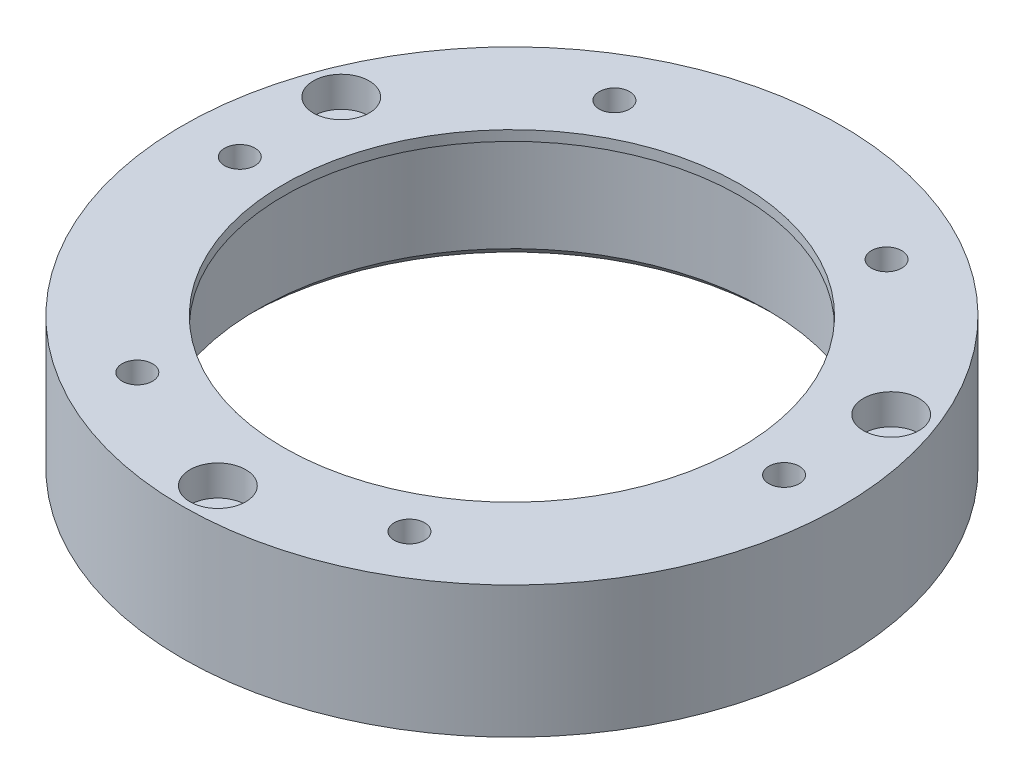
ISO-10303-21;
HEADER;
FILE_DESCRIPTION(('STEP AP214'),'2;1');
FILE_NAME('part.step','',(''),(''),'','','');
FILE_SCHEMA(('AUTOMOTIVE_DESIGN { 1 0 10303 214 1 1 1 1 }'));
ENDSEC;
DATA;
#1=APPLICATION_CONTEXT('core data for automotive mechanical design processes');
#2=APPLICATION_PROTOCOL_DEFINITION('international standard','automotive_design',2000,#1);
#3=PRODUCT_CONTEXT('',#1,'mechanical');
#4=PRODUCT('Part','Part','',(#3));
#5=PRODUCT_RELATED_PRODUCT_CATEGORY('part','',(#4));
#6=PRODUCT_DEFINITION_FORMATION('','',#4);
#7=PRODUCT_DEFINITION_CONTEXT('part definition',#1,'design');
#8=PRODUCT_DEFINITION('design','',#6,#7);
#9=PRODUCT_DEFINITION_SHAPE('','',#8);
#10=(LENGTH_UNIT() NAMED_UNIT(*) SI_UNIT(.MILLI.,.METRE.));
#11=(NAMED_UNIT(*) PLANE_ANGLE_UNIT() SI_UNIT($,.RADIAN.));
#12=(NAMED_UNIT(*) SI_UNIT($,.STERADIAN.) SOLID_ANGLE_UNIT());
#13=UNCERTAINTY_MEASURE_WITH_UNIT(LENGTH_MEASURE(1.E-05),#10,'distance_accuracy_value','');
#14=(GEOMETRIC_REPRESENTATION_CONTEXT(3) GLOBAL_UNCERTAINTY_ASSIGNED_CONTEXT((#13)) GLOBAL_UNIT_ASSIGNED_CONTEXT((#10,
#11,#12)) REPRESENTATION_CONTEXT('',''));
#15=CARTESIAN_POINT('',(0.,0.,0.));
#16=DIRECTION('',(0.,0.,1.));
#17=DIRECTION('',(1.,0.,0.));
#18=AXIS2_PLACEMENT_3D('',#15,#16,#17);
#19=CARTESIAN_POINT('',(-27.1153329726164,13.,-10.283905765036));
#20=DIRECTION('',(0.,-1.,0.));
#21=DIRECTION('',(0.,0.,-1.));
#22=AXIS2_PLACEMENT_3D('',#19,#20,#21);
#23=CYLINDRICAL_SURFACE('',#22,1.5);
#24=CARTESIAN_POINT('',(-27.1153329726164,0.,-10.283905765036));
#25=DIRECTION('',(0.,-1.,0.));
#26=DIRECTION('',(0.,0.,-1.));
#27=AXIS2_PLACEMENT_3D('',#24,#25,#26);
#28=CIRCLE('',#27,1.5);
#29=CARTESIAN_POINT('',(-27.1153329726164,0.,-11.783905765036));
#30=VERTEX_POINT('',#29);
#31=EDGE_CURVE('E63',#30,#30,#28,.T.);
#32=ORIENTED_EDGE('',*,*,#31,.T.);
#33=EDGE_LOOP('',(#32));
#34=FACE_BOUND('',#33,.T.);
#35=CARTESIAN_POINT('',(-27.1153329726164,10.,-10.283905765036));
#36=DIRECTION('',(0.,1.,0.));
#37=DIRECTION('',(0.,0.,1.));
#38=AXIS2_PLACEMENT_3D('',#35,#36,#37);
#39=CIRCLE('',#38,1.5);
#40=CARTESIAN_POINT('',(-27.1153329726164,10.,-8.78390576503595));
#41=VERTEX_POINT('',#40);
#42=EDGE_CURVE('E42',#41,#41,#39,.F.);
#43=ORIENTED_EDGE('',*,*,#42,.F.);
#44=EDGE_LOOP('',(#43));
#45=FACE_BOUND('',#44,.T.);
#46=ADVANCED_FACE('F37',(#34,#45),#23,.F.);
#47=CARTESIAN_POINT('',(27.1153329726164,13.,-10.283905765036));
#48=DIRECTION('',(0.,-1.,0.));
#49=DIRECTION('',(0.,0.,-1.));
#50=AXIS2_PLACEMENT_3D('',#47,#48,#49);
#51=CYLINDRICAL_SURFACE('',#50,1.5);
#52=CARTESIAN_POINT('',(27.1153329726164,0.,-10.283905765036));
#53=DIRECTION('',(0.,-1.,0.));
#54=DIRECTION('',(0.,0.,-1.));
#55=AXIS2_PLACEMENT_3D('',#52,#53,#54);
#56=CIRCLE('',#55,1.5);
#57=CARTESIAN_POINT('',(27.1153329726164,0.,-11.783905765036));
#58=VERTEX_POINT('',#57);
#59=EDGE_CURVE('E67',#58,#58,#56,.T.);
#60=ORIENTED_EDGE('',*,*,#59,.T.);
#61=EDGE_LOOP('',(#60));
#62=FACE_BOUND('',#61,.T.);
#63=CARTESIAN_POINT('',(27.1153329726164,10.,-10.283905765036));
#64=DIRECTION('',(0.,1.,0.));
#65=DIRECTION('',(0.,0.,1.));
#66=AXIS2_PLACEMENT_3D('',#63,#64,#65);
#67=CIRCLE('',#66,1.5);
#68=CARTESIAN_POINT('',(27.1153329726164,10.,-8.78390576503596));
#69=VERTEX_POINT('',#68);
#70=EDGE_CURVE('E57',#69,#69,#67,.F.);
#71=ORIENTED_EDGE('',*,*,#70,.F.);
#72=EDGE_LOOP('',(#71));
#73=FACE_BOUND('',#72,.T.);
#74=ADVANCED_FACE('F108',(#62,#73),#51,.F.);
#75=CARTESIAN_POINT('',(0.,13.,29.));
#76=DIRECTION('',(0.,-1.,0.));
#77=DIRECTION('',(0.,0.,-1.));
#78=AXIS2_PLACEMENT_3D('',#75,#76,#77);
#79=CYLINDRICAL_SURFACE('',#78,1.5);
#80=CARTESIAN_POINT('',(0.,0.,29.));
#81=DIRECTION('',(0.,-1.,0.));
#82=DIRECTION('',(0.,0.,-1.));
#83=AXIS2_PLACEMENT_3D('',#80,#81,#82);
#84=CIRCLE('',#83,1.5);
#85=CARTESIAN_POINT('',(0.,0.,27.5));
#86=VERTEX_POINT('',#85);
#87=EDGE_CURVE('E72',#86,#86,#84,.T.);
#88=ORIENTED_EDGE('',*,*,#87,.T.);
#89=EDGE_LOOP('',(#88));
#90=FACE_BOUND('',#89,.T.);
#91=CARTESIAN_POINT('',(0.,10.,29.));
#92=DIRECTION('',(0.,1.,0.));
#93=DIRECTION('',(0.,0.,1.));
#94=AXIS2_PLACEMENT_3D('',#91,#92,#93);
#95=CIRCLE('',#94,1.5);
#96=CARTESIAN_POINT('',(0.,10.,30.5));
#97=VERTEX_POINT('',#96);
#98=EDGE_CURVE('E55',#97,#97,#95,.F.);
#99=ORIENTED_EDGE('',*,*,#98,.F.);
#100=EDGE_LOOP('',(#99));
#101=FACE_BOUND('',#100,.T.);
#102=ADVANCED_FACE('F113',(#90,#101),#79,.F.);
#103=CARTESIAN_POINT('',(0.,13.,0.));
#104=DIRECTION('',(0.,-1.,0.));
#105=DIRECTION('',(0.,0.,-1.));
#106=AXIS2_PLACEMENT_3D('',#103,#104,#105);
#107=CYLINDRICAL_SURFACE('',#106,25.1);
#108=CARTESIAN_POINT('',(0.,1.,0.));
#109=DIRECTION('',(0.,1.,0.));
#110=DIRECTION('',(0.,0.,1.));
#111=AXIS2_PLACEMENT_3D('',#108,#109,#110);
#112=CIRCLE('',#111,25.1);
#113=CARTESIAN_POINT('',(0.,1.,25.1));
#114=VERTEX_POINT('',#113);
#115=EDGE_CURVE('E10',#114,#114,#112,.F.);
#116=ORIENTED_EDGE('',*,*,#115,.T.);
#117=EDGE_LOOP('',(#116));
#118=FACE_BOUND('',#117,.T.);
#119=CARTESIAN_POINT('',(0.,12.,0.));
#120=DIRECTION('',(0.,1.,0.));
#121=DIRECTION('',(0.,0.,1.));
#122=AXIS2_PLACEMENT_3D('',#119,#120,#121);
#123=CIRCLE('',#122,25.1);
#124=CARTESIAN_POINT('',(0.,12.,25.1));
#125=VERTEX_POINT('',#124);
#126=EDGE_CURVE('E79',#125,#125,#123,.T.);
#127=ORIENTED_EDGE('',*,*,#126,.T.);
#128=EDGE_LOOP('',(#127));
#129=FACE_BOUND('',#128,.T.);
#130=ADVANCED_FACE('F103',(#118,#129),#107,.F.);
#131=CARTESIAN_POINT('',(0.,13.,0.));
#132=DIRECTION('',(0.,1.,0.));
#133=DIRECTION('',(0.,0.,1.));
#134=AXIS2_PLACEMENT_3D('',#131,#132,#133);
#135=PLANE('',#134);
#136=CARTESIAN_POINT('',(-13.3576776228059,13.,-23.4642802686366));
#137=DIRECTION('',(0.,1.,0.));
#138=DIRECTION('',(0.,0.,1.));
#139=AXIS2_PLACEMENT_3D('',#136,#137,#138);
#140=CIRCLE('',#139,1.5);
#141=CARTESIAN_POINT('',(-13.3576776228059,13.,-21.9642802686366));
#142=VERTEX_POINT('',#141);
#143=EDGE_CURVE('E245',#142,#142,#140,.T.);
#144=ORIENTED_EDGE('',*,*,#143,.F.);
#145=EDGE_LOOP('',(#144));
#146=FACE_BOUND('',#145,.T.);
#147=CARTESIAN_POINT('',(-26.9995016055596,13.,-0.164051977404498));
#148=DIRECTION('',(0.,1.,0.));
#149=DIRECTION('',(0.,0.,1.));
#150=AXIS2_PLACEMENT_3D('',#147,#148,#149);
#151=CIRCLE('',#150,1.5);
#152=CARTESIAN_POINT('',(-26.9995016055596,13.,1.3359480225955));
#153=VERTEX_POINT('',#152);
#154=EDGE_CURVE('E239',#153,#153,#151,.T.);
#155=ORIENTED_EDGE('',*,*,#154,.F.);
#156=EDGE_LOOP('',(#155));
#157=FACE_BOUND('',#156,.T.);
#158=CARTESIAN_POINT('',(-13.6418239827526,13.,23.3002282912321));
#159=DIRECTION('',(0.,1.,0.));
#160=DIRECTION('',(0.,0.,1.));
#161=AXIS2_PLACEMENT_3D('',#158,#159,#160);
#162=CIRCLE('',#161,1.5);
#163=CARTESIAN_POINT('',(-13.6418239827526,13.,24.8002282912321));
#164=VERTEX_POINT('',#163);
#165=EDGE_CURVE('E233',#164,#164,#162,.T.);
#166=ORIENTED_EDGE('',*,*,#165,.F.);
#167=EDGE_LOOP('',(#166));
#168=FACE_BOUND('',#167,.T.);
#169=CARTESIAN_POINT('',(13.3576776228082,13.,23.4642802686366));
#170=DIRECTION('',(0.,1.,0.));
#171=DIRECTION('',(0.,0.,1.));
#172=AXIS2_PLACEMENT_3D('',#169,#170,#171);
#173=CIRCLE('',#172,1.5);
#174=CARTESIAN_POINT('',(13.3576776228082,13.,24.9642802686366));
#175=VERTEX_POINT('',#174);
#176=EDGE_CURVE('E225',#175,#175,#173,.T.);
#177=ORIENTED_EDGE('',*,*,#176,.F.);
#178=EDGE_LOOP('',(#177));
#179=FACE_BOUND('',#178,.T.);
#180=CARTESIAN_POINT('',(26.9995016055619,13.,0.164051977404505));
#181=DIRECTION('',(0.,1.,0.));
#182=DIRECTION('',(0.,0.,1.));
#183=AXIS2_PLACEMENT_3D('',#180,#181,#182);
#184=CIRCLE('',#183,1.5);
#185=CARTESIAN_POINT('',(26.9995016055619,13.,1.66405197740451));
#186=VERTEX_POINT('',#185);
#187=EDGE_CURVE('E218',#186,#186,#184,.T.);
#188=ORIENTED_EDGE('',*,*,#187,.F.);
#189=EDGE_LOOP('',(#188));
#190=FACE_BOUND('',#189,.T.);
#191=CARTESIAN_POINT('',(13.6418239827549,13.,-23.3002282912321));
#192=DIRECTION('',(0.,1.,0.));
#193=DIRECTION('',(0.,0.,1.));
#194=AXIS2_PLACEMENT_3D('',#191,#192,#193);
#195=CIRCLE('',#194,1.5);
#196=CARTESIAN_POINT('',(13.6418239827549,13.,-21.8002282912321));
#197=VERTEX_POINT('',#196);
#198=EDGE_CURVE('E220',#197,#197,#195,.T.);
#199=ORIENTED_EDGE('',*,*,#198,.F.);
#200=EDGE_LOOP('',(#199));
#201=FACE_BOUND('',#200,.T.);
#202=CARTESIAN_POINT('',(-27.1153329726164,13.,-10.283905765036));
#203=DIRECTION('',(0.,1.,0.));
#204=DIRECTION('',(0.,0.,1.));
#205=AXIS2_PLACEMENT_3D('',#202,#203,#204);
#206=CIRCLE('',#205,2.75);
#207=CARTESIAN_POINT('',(-27.1153329726164,13.,-7.53390576503595));
#208=VERTEX_POINT('',#207);
#209=EDGE_CURVE('E256',#208,#208,#206,.T.);
#210=ORIENTED_EDGE('',*,*,#209,.F.);
#211=EDGE_LOOP('',(#210));
#212=FACE_BOUND('',#211,.T.);
#213=CARTESIAN_POINT('',(27.1153329726164,13.,-10.283905765036));
#214=DIRECTION('',(0.,1.,0.));
#215=DIRECTION('',(0.,0.,1.));
#216=AXIS2_PLACEMENT_3D('',#213,#214,#215);
#217=CIRCLE('',#216,2.75);
#218=CARTESIAN_POINT('',(27.1153329726164,13.,-7.53390576503596));
#219=VERTEX_POINT('',#218);
#220=EDGE_CURVE('E259',#219,#219,#217,.T.);
#221=ORIENTED_EDGE('',*,*,#220,.F.);
#222=EDGE_LOOP('',(#221));
#223=FACE_BOUND('',#222,.T.);
#224=CARTESIAN_POINT('',(0.,13.,29.));
#225=DIRECTION('',(0.,1.,0.));
#226=DIRECTION('',(0.,0.,1.));
#227=AXIS2_PLACEMENT_3D('',#224,#225,#226);
#228=CIRCLE('',#227,2.75);
#229=CARTESIAN_POINT('',(0.,13.,31.75));
#230=VERTEX_POINT('',#229);
#231=EDGE_CURVE('E265',#230,#230,#228,.T.);
#232=ORIENTED_EDGE('',*,*,#231,.F.);
#233=EDGE_LOOP('',(#232));
#234=FACE_BOUND('',#233,.T.);
#235=CARTESIAN_POINT('',(0.,13.,0.));
#236=DIRECTION('',(0.,1.,0.));
#237=DIRECTION('',(0.,0.,1.));
#238=AXIS2_PLACEMENT_3D('',#235,#236,#237);
#239=CIRCLE('',#238,32.5);
#240=CARTESIAN_POINT('',(0.,13.,32.5));
#241=VERTEX_POINT('',#240);
#242=EDGE_CURVE('E51',#241,#241,#239,.T.);
#243=ORIENTED_EDGE('',*,*,#242,.T.);
#244=EDGE_LOOP('',(#243));
#245=FACE_BOUND('',#244,.T.);
#246=CARTESIAN_POINT('',(0.,13.,0.));
#247=DIRECTION('',(0.,1.,0.));
#248=DIRECTION('',(0.,0.,1.));
#249=AXIS2_PLACEMENT_3D('',#246,#247,#248);
#250=CIRCLE('',#249,22.5);
#251=CARTESIAN_POINT('',(0.,13.,22.5));
#252=VERTEX_POINT('',#251);
#253=EDGE_CURVE('E80',#252,#252,#250,.T.);
#254=ORIENTED_EDGE('',*,*,#253,.F.);
#255=EDGE_LOOP('',(#254));
#256=FACE_BOUND('',#255,.T.);
#257=ADVANCED_FACE('F94',(#146,#157,#168,#179,#190,#201,#212,#223,#234,#245,#256),#135,.T.);
#258=CARTESIAN_POINT('',(0.,0.,0.));
#259=DIRECTION('',(0.,1.,0.));
#260=DIRECTION('',(0.,0.,1.));
#261=AXIS2_PLACEMENT_3D('',#258,#259,#260);
#262=PLANE('',#261);
#263=CARTESIAN_POINT('',(0.,0.,0.));
#264=DIRECTION('',(0.,1.,0.));
#265=DIRECTION('',(0.,0.,1.));
#266=AXIS2_PLACEMENT_3D('',#263,#264,#265);
#267=CIRCLE('',#266,26.1);
#268=CARTESIAN_POINT('',(0.,0.,26.1));
#269=VERTEX_POINT('',#268);
#270=EDGE_CURVE('E46',#269,#269,#267,.T.);
#271=ORIENTED_EDGE('',*,*,#270,.T.);
#272=EDGE_LOOP('',(#271));
#273=FACE_BOUND('',#272,.T.);
#274=ORIENTED_EDGE('',*,*,#87,.F.);
#275=EDGE_LOOP('',(#274));
#276=FACE_BOUND('',#275,.T.);
#277=ORIENTED_EDGE('',*,*,#59,.F.);
#278=EDGE_LOOP('',(#277));
#279=FACE_BOUND('',#278,.T.);
#280=ORIENTED_EDGE('',*,*,#31,.F.);
#281=EDGE_LOOP('',(#280));
#282=FACE_BOUND('',#281,.T.);
#283=CARTESIAN_POINT('',(0.,0.,0.));
#284=DIRECTION('',(0.,1.,0.));
#285=DIRECTION('',(0.,0.,1.));
#286=AXIS2_PLACEMENT_3D('',#283,#284,#285);
#287=CIRCLE('',#286,32.5);
#288=CARTESIAN_POINT('',(0.,0.,32.5));
#289=VERTEX_POINT('',#288);
#290=EDGE_CURVE('E85',#289,#289,#287,.T.);
#291=ORIENTED_EDGE('',*,*,#290,.F.);
#292=EDGE_LOOP('',(#291));
#293=FACE_BOUND('',#292,.T.);
#294=ADVANCED_FACE('F92',(#273,#276,#279,#282,#293),#262,.F.);
#295=CARTESIAN_POINT('',(0.,13.,0.));
#296=DIRECTION('',(0.,-1.,0.));
#297=DIRECTION('',(0.,0.,-1.));
#298=AXIS2_PLACEMENT_3D('',#295,#296,#297);
#299=CYLINDRICAL_SURFACE('',#298,32.5);
#300=ORIENTED_EDGE('',*,*,#242,.F.);
#301=EDGE_LOOP('',(#300));
#302=FACE_BOUND('',#301,.T.);
#303=ORIENTED_EDGE('',*,*,#290,.T.);
#304=EDGE_LOOP('',(#303));
#305=FACE_BOUND('',#304,.T.);
#306=ADVANCED_FACE('F90',(#302,#305),#299,.T.);
#307=CARTESIAN_POINT('',(0.,12.,0.));
#308=DIRECTION('',(0.,1.,0.));
#309=DIRECTION('',(0.,0.,1.));
#310=AXIS2_PLACEMENT_3D('',#307,#308,#309);
#311=PLANE('',#310);
#312=CARTESIAN_POINT('',(0.,12.,0.));
#313=DIRECTION('',(0.,1.,0.));
#314=DIRECTION('',(0.,0.,1.));
#315=AXIS2_PLACEMENT_3D('',#312,#313,#314);
#316=CIRCLE('',#315,22.5);
#317=CARTESIAN_POINT('',(0.,12.,22.5));
#318=VERTEX_POINT('',#317);
#319=EDGE_CURVE('E76',#318,#318,#316,.T.);
#320=ORIENTED_EDGE('',*,*,#319,.T.);
#321=EDGE_LOOP('',(#320));
#322=FACE_BOUND('',#321,.T.);
#323=ORIENTED_EDGE('',*,*,#126,.F.);
#324=EDGE_LOOP('',(#323));
#325=FACE_BOUND('',#324,.T.);
#326=ADVANCED_FACE('F101',(#322,#325),#311,.F.);
#327=CARTESIAN_POINT('',(0.,12.,0.));
#328=DIRECTION('',(0.,1.,0.));
#329=DIRECTION('',(0.,0.,1.));
#330=AXIS2_PLACEMENT_3D('',#327,#328,#329);
#331=CYLINDRICAL_SURFACE('',#330,22.5);
#332=ORIENTED_EDGE('',*,*,#319,.F.);
#333=EDGE_LOOP('',(#332));
#334=FACE_BOUND('',#333,.T.);
#335=ORIENTED_EDGE('',*,*,#253,.T.);
#336=EDGE_LOOP('',(#335));
#337=FACE_BOUND('',#336,.T.);
#338=ADVANCED_FACE('F119',(#334,#337),#331,.F.);
#339=CARTESIAN_POINT('',(0.,0.,0.));
#340=DIRECTION('',(0.,-1.,0.));
#341=DIRECTION('',(0.,0.,-1.));
#342=AXIS2_PLACEMENT_3D('',#339,#340,#341);
#343=CONICAL_SURFACE('',#342,26.1,0.785398163397443);
#344=ORIENTED_EDGE('',*,*,#115,.F.);
#345=EDGE_LOOP('',(#344));
#346=FACE_BOUND('',#345,.T.);
#347=ORIENTED_EDGE('',*,*,#270,.F.);
#348=EDGE_LOOP('',(#347));
#349=FACE_BOUND('',#348,.T.);
#350=ADVANCED_FACE('F40',(#346,#349),#343,.F.);
#351=CARTESIAN_POINT('',(0.,10.,29.));
#352=DIRECTION('',(0.,1.,0.));
#353=DIRECTION('',(0.,0.,1.));
#354=AXIS2_PLACEMENT_3D('',#351,#352,#353);
#355=PLANE('',#354);
#356=CARTESIAN_POINT('',(0.,10.,29.));
#357=DIRECTION('',(0.,1.,0.));
#358=DIRECTION('',(0.,0.,1.));
#359=AXIS2_PLACEMENT_3D('',#356,#357,#358);
#360=CIRCLE('',#359,2.75);
#361=CARTESIAN_POINT('',(0.,10.,31.75));
#362=VERTEX_POINT('',#361);
#363=EDGE_CURVE('E252',#362,#362,#360,.T.);
#364=ORIENTED_EDGE('',*,*,#363,.T.);
#365=EDGE_LOOP('',(#364));
#366=FACE_BOUND('',#365,.T.);
#367=ORIENTED_EDGE('',*,*,#98,.T.);
#368=EDGE_LOOP('',(#367));
#369=FACE_BOUND('',#368,.T.);
#370=ADVANCED_FACE('F139',(#366,#369),#355,.T.);
#371=CARTESIAN_POINT('',(0.,10.,29.));
#372=DIRECTION('',(0.,1.,0.));
#373=DIRECTION('',(0.,0.,1.));
#374=AXIS2_PLACEMENT_3D('',#371,#372,#373);
#375=CYLINDRICAL_SURFACE('',#374,2.75);
#376=ORIENTED_EDGE('',*,*,#363,.F.);
#377=EDGE_LOOP('',(#376));
#378=FACE_BOUND('',#377,.T.);
#379=ORIENTED_EDGE('',*,*,#231,.T.);
#380=EDGE_LOOP('',(#379));
#381=FACE_BOUND('',#380,.T.);
#382=ADVANCED_FACE('F142',(#378,#381),#375,.F.);
#383=CARTESIAN_POINT('',(27.1153329726164,10.,-10.283905765036));
#384=DIRECTION('',(0.,1.,0.));
#385=DIRECTION('',(0.,0.,1.));
#386=AXIS2_PLACEMENT_3D('',#383,#384,#385);
#387=PLANE('',#386);
#388=CARTESIAN_POINT('',(27.1153329726164,10.,-10.283905765036));
#389=DIRECTION('',(0.,1.,0.));
#390=DIRECTION('',(0.,0.,1.));
#391=AXIS2_PLACEMENT_3D('',#388,#389,#390);
#392=CIRCLE('',#391,2.75);
#393=CARTESIAN_POINT('',(27.1153329726164,10.,-7.53390576503596));
#394=VERTEX_POINT('',#393);
#395=EDGE_CURVE('E262',#394,#394,#392,.T.);
#396=ORIENTED_EDGE('',*,*,#395,.T.);
#397=EDGE_LOOP('',(#396));
#398=FACE_BOUND('',#397,.T.);
#399=ORIENTED_EDGE('',*,*,#70,.T.);
#400=EDGE_LOOP('',(#399));
#401=FACE_BOUND('',#400,.T.);
#402=ADVANCED_FACE('F146',(#398,#401),#387,.T.);
#403=CARTESIAN_POINT('',(27.1153329726164,10.,-10.283905765036));
#404=DIRECTION('',(0.,1.,0.));
#405=DIRECTION('',(0.,0.,1.));
#406=AXIS2_PLACEMENT_3D('',#403,#404,#405);
#407=CYLINDRICAL_SURFACE('',#406,2.75);
#408=ORIENTED_EDGE('',*,*,#395,.F.);
#409=EDGE_LOOP('',(#408));
#410=FACE_BOUND('',#409,.T.);
#411=ORIENTED_EDGE('',*,*,#220,.T.);
#412=EDGE_LOOP('',(#411));
#413=FACE_BOUND('',#412,.T.);
#414=ADVANCED_FACE('F150',(#410,#413),#407,.F.);
#415=CARTESIAN_POINT('',(-27.1153329726164,10.,-10.283905765036));
#416=DIRECTION('',(0.,1.,0.));
#417=DIRECTION('',(0.,0.,1.));
#418=AXIS2_PLACEMENT_3D('',#415,#416,#417);
#419=PLANE('',#418);
#420=CARTESIAN_POINT('',(-27.1153329726164,10.,-10.283905765036));
#421=DIRECTION('',(0.,1.,0.));
#422=DIRECTION('',(0.,0.,1.));
#423=AXIS2_PLACEMENT_3D('',#420,#421,#422);
#424=CIRCLE('',#423,2.75);
#425=CARTESIAN_POINT('',(-27.1153329726164,10.,-7.53390576503595));
#426=VERTEX_POINT('',#425);
#427=EDGE_CURVE('E58',#426,#426,#424,.T.);
#428=ORIENTED_EDGE('',*,*,#427,.T.);
#429=EDGE_LOOP('',(#428));
#430=FACE_BOUND('',#429,.T.);
#431=ORIENTED_EDGE('',*,*,#42,.T.);
#432=EDGE_LOOP('',(#431));
#433=FACE_BOUND('',#432,.T.);
#434=ADVANCED_FACE('F154',(#430,#433),#419,.T.);
#435=CARTESIAN_POINT('',(-27.1153329726164,10.,-10.283905765036));
#436=DIRECTION('',(0.,1.,0.));
#437=DIRECTION('',(0.,0.,1.));
#438=AXIS2_PLACEMENT_3D('',#435,#436,#437);
#439=CYLINDRICAL_SURFACE('',#438,2.75);
#440=ORIENTED_EDGE('',*,*,#427,.F.);
#441=EDGE_LOOP('',(#440));
#442=FACE_BOUND('',#441,.T.);
#443=ORIENTED_EDGE('',*,*,#209,.T.);
#444=EDGE_LOOP('',(#443));
#445=FACE_BOUND('',#444,.T.);
#446=ADVANCED_FACE('F156',(#442,#445),#439,.F.);
#447=CARTESIAN_POINT('',(13.6418239827549,3.,-23.3002282912321));
#448=DIRECTION('',(0.,1.,0.));
#449=DIRECTION('',(0.,0.,1.));
#450=AXIS2_PLACEMENT_3D('',#447,#448,#449);
#451=CYLINDRICAL_SURFACE('',#450,1.5);
#452=CARTESIAN_POINT('',(13.6418239827549,3.,-23.3002282912321));
#453=DIRECTION('',(0.,1.,0.));
#454=DIRECTION('',(0.,0.,1.));
#455=AXIS2_PLACEMENT_3D('',#452,#453,#454);
#456=CIRCLE('',#455,1.5);
#457=CARTESIAN_POINT('',(13.6418239827549,3.,-21.8002282912321));
#458=VERTEX_POINT('',#457);
#459=EDGE_CURVE('E223',#458,#458,#456,.T.);
#460=ORIENTED_EDGE('',*,*,#459,.F.);
#461=EDGE_LOOP('',(#460));
#462=FACE_BOUND('',#461,.T.);
#463=ORIENTED_EDGE('',*,*,#198,.T.);
#464=EDGE_LOOP('',(#463));
#465=FACE_BOUND('',#464,.T.);
#466=ADVANCED_FACE('F159',(#462,#465),#451,.F.);
#467=CARTESIAN_POINT('',(13.6418239827549,3.,-23.3002282912321));
#468=DIRECTION('',(0.,1.,0.));
#469=DIRECTION('',(0.,0.,1.));
#470=AXIS2_PLACEMENT_3D('',#467,#468,#469);
#471=PLANE('',#470);
#472=ORIENTED_EDGE('',*,*,#459,.T.);
#473=EDGE_LOOP('',(#472));
#474=FACE_BOUND('',#473,.T.);
#475=ADVANCED_FACE('F166',(#474),#471,.T.);
#476=CARTESIAN_POINT('',(26.9995016055619,3.,0.164051977404505));
#477=DIRECTION('',(0.,1.,0.));
#478=DIRECTION('',(0.,0.,1.));
#479=AXIS2_PLACEMENT_3D('',#476,#477,#478);
#480=CYLINDRICAL_SURFACE('',#479,1.5);
#481=CARTESIAN_POINT('',(26.9995016055619,3.,0.164051977404505));
#482=DIRECTION('',(0.,1.,0.));
#483=DIRECTION('',(0.,0.,1.));
#484=AXIS2_PLACEMENT_3D('',#481,#482,#483);
#485=CIRCLE('',#484,1.5);
#486=CARTESIAN_POINT('',(26.9995016055619,3.,1.66405197740451));
#487=VERTEX_POINT('',#486);
#488=EDGE_CURVE('E215',#487,#487,#485,.T.);
#489=ORIENTED_EDGE('',*,*,#488,.F.);
#490=EDGE_LOOP('',(#489));
#491=FACE_BOUND('',#490,.T.);
#492=ORIENTED_EDGE('',*,*,#187,.T.);
#493=EDGE_LOOP('',(#492));
#494=FACE_BOUND('',#493,.T.);
#495=ADVANCED_FACE('F170',(#491,#494),#480,.F.);
#496=CARTESIAN_POINT('',(26.9995016055619,3.,0.164051977404505));
#497=DIRECTION('',(0.,1.,0.));
#498=DIRECTION('',(0.,0.,1.));
#499=AXIS2_PLACEMENT_3D('',#496,#497,#498);
#500=PLANE('',#499);
#501=ORIENTED_EDGE('',*,*,#488,.T.);
#502=EDGE_LOOP('',(#501));
#503=FACE_BOUND('',#502,.T.);
#504=ADVANCED_FACE('F203',(#503),#500,.T.);
#505=CARTESIAN_POINT('',(13.3576776228082,3.,23.4642802686366));
#506=DIRECTION('',(0.,1.,0.));
#507=DIRECTION('',(0.,0.,1.));
#508=AXIS2_PLACEMENT_3D('',#505,#506,#507);
#509=CYLINDRICAL_SURFACE('',#508,1.5);
#510=CARTESIAN_POINT('',(13.3576776228082,3.,23.4642802686366));
#511=DIRECTION('',(0.,1.,0.));
#512=DIRECTION('',(0.,0.,1.));
#513=AXIS2_PLACEMENT_3D('',#510,#511,#512);
#514=CIRCLE('',#513,1.5);
#515=CARTESIAN_POINT('',(13.3576776228082,3.,24.9642802686366));
#516=VERTEX_POINT('',#515);
#517=EDGE_CURVE('E230',#516,#516,#514,.T.);
#518=ORIENTED_EDGE('',*,*,#517,.F.);
#519=EDGE_LOOP('',(#518));
#520=FACE_BOUND('',#519,.T.);
#521=ORIENTED_EDGE('',*,*,#176,.T.);
#522=EDGE_LOOP('',(#521));
#523=FACE_BOUND('',#522,.T.);
#524=ADVANCED_FACE('F199',(#520,#523),#509,.F.);
#525=CARTESIAN_POINT('',(13.3576776228082,3.,23.4642802686366));
#526=DIRECTION('',(0.,1.,0.));
#527=DIRECTION('',(0.,0.,1.));
#528=AXIS2_PLACEMENT_3D('',#525,#526,#527);
#529=PLANE('',#528);
#530=ORIENTED_EDGE('',*,*,#517,.T.);
#531=EDGE_LOOP('',(#530));
#532=FACE_BOUND('',#531,.T.);
#533=ADVANCED_FACE('F195',(#532),#529,.T.);
#534=CARTESIAN_POINT('',(-13.6418239827526,3.,23.3002282912321));
#535=DIRECTION('',(0.,1.,0.));
#536=DIRECTION('',(0.,0.,1.));
#537=AXIS2_PLACEMENT_3D('',#534,#535,#536);
#538=CYLINDRICAL_SURFACE('',#537,1.5);
#539=CARTESIAN_POINT('',(-13.6418239827526,3.,23.3002282912321));
#540=DIRECTION('',(0.,1.,0.));
#541=DIRECTION('',(0.,0.,1.));
#542=AXIS2_PLACEMENT_3D('',#539,#540,#541);
#543=CIRCLE('',#542,1.5);
#544=CARTESIAN_POINT('',(-13.6418239827526,3.,24.8002282912321));
#545=VERTEX_POINT('',#544);
#546=EDGE_CURVE('E236',#545,#545,#543,.T.);
#547=ORIENTED_EDGE('',*,*,#546,.F.);
#548=EDGE_LOOP('',(#547));
#549=FACE_BOUND('',#548,.T.);
#550=ORIENTED_EDGE('',*,*,#165,.T.);
#551=EDGE_LOOP('',(#550));
#552=FACE_BOUND('',#551,.T.);
#553=ADVANCED_FACE('F191',(#549,#552),#538,.F.);
#554=CARTESIAN_POINT('',(-13.6418239827526,3.,23.3002282912321));
#555=DIRECTION('',(0.,1.,0.));
#556=DIRECTION('',(0.,0.,1.));
#557=AXIS2_PLACEMENT_3D('',#554,#555,#556);
#558=PLANE('',#557);
#559=ORIENTED_EDGE('',*,*,#546,.T.);
#560=EDGE_LOOP('',(#559));
#561=FACE_BOUND('',#560,.T.);
#562=ADVANCED_FACE('F187',(#561),#558,.T.);
#563=CARTESIAN_POINT('',(-26.9995016055596,3.,-0.164051977404498));
#564=DIRECTION('',(0.,1.,0.));
#565=DIRECTION('',(0.,0.,1.));
#566=AXIS2_PLACEMENT_3D('',#563,#564,#565);
#567=CYLINDRICAL_SURFACE('',#566,1.5);
#568=CARTESIAN_POINT('',(-26.9995016055596,3.,-0.164051977404498));
#569=DIRECTION('',(0.,1.,0.));
#570=DIRECTION('',(0.,0.,1.));
#571=AXIS2_PLACEMENT_3D('',#568,#569,#570);
#572=CIRCLE('',#571,1.5);
#573=CARTESIAN_POINT('',(-26.9995016055596,3.,1.3359480225955));
#574=VERTEX_POINT('',#573);
#575=EDGE_CURVE('E242',#574,#574,#572,.T.);
#576=ORIENTED_EDGE('',*,*,#575,.F.);
#577=EDGE_LOOP('',(#576));
#578=FACE_BOUND('',#577,.T.);
#579=ORIENTED_EDGE('',*,*,#154,.T.);
#580=EDGE_LOOP('',(#579));
#581=FACE_BOUND('',#580,.T.);
#582=ADVANCED_FACE('F183',(#578,#581),#567,.F.);
#583=CARTESIAN_POINT('',(-26.9995016055596,3.,-0.164051977404498));
#584=DIRECTION('',(0.,1.,0.));
#585=DIRECTION('',(0.,0.,1.));
#586=AXIS2_PLACEMENT_3D('',#583,#584,#585);
#587=PLANE('',#586);
#588=ORIENTED_EDGE('',*,*,#575,.T.);
#589=EDGE_LOOP('',(#588));
#590=FACE_BOUND('',#589,.T.);
#591=ADVANCED_FACE('F179',(#590),#587,.T.);
#592=CARTESIAN_POINT('',(-13.3576776228059,3.,-23.4642802686366));
#593=DIRECTION('',(0.,1.,0.));
#594=DIRECTION('',(0.,0.,1.));
#595=AXIS2_PLACEMENT_3D('',#592,#593,#594);
#596=CYLINDRICAL_SURFACE('',#595,1.5);
#597=CARTESIAN_POINT('',(-13.3576776228059,3.,-23.4642802686366));
#598=DIRECTION('',(0.,1.,0.));
#599=DIRECTION('',(0.,0.,1.));
#600=AXIS2_PLACEMENT_3D('',#597,#598,#599);
#601=CIRCLE('',#600,1.5);
#602=CARTESIAN_POINT('',(-13.3576776228059,3.,-21.9642802686366));
#603=VERTEX_POINT('',#602);
#604=EDGE_CURVE('E248',#603,#603,#601,.T.);
#605=ORIENTED_EDGE('',*,*,#604,.F.);
#606=EDGE_LOOP('',(#605));
#607=FACE_BOUND('',#606,.T.);
#608=ORIENTED_EDGE('',*,*,#143,.T.);
#609=EDGE_LOOP('',(#608));
#610=FACE_BOUND('',#609,.T.);
#611=ADVANCED_FACE('F175',(#607,#610),#596,.F.);
#612=CARTESIAN_POINT('',(-13.3576776228059,3.,-23.4642802686366));
#613=DIRECTION('',(0.,1.,0.));
#614=DIRECTION('',(0.,0.,1.));
#615=AXIS2_PLACEMENT_3D('',#612,#613,#614);
#616=PLANE('',#615);
#617=ORIENTED_EDGE('',*,*,#604,.T.);
#618=EDGE_LOOP('',(#617));
#619=FACE_BOUND('',#618,.T.);
#620=ADVANCED_FACE('F172',(#619),#616,.T.);
#621=CLOSED_SHELL('',(#46,#74,#102,#130,#257,#294,#306,#326,#338,#350,#370,#382,#402,#414,#434,
#446,#466,#475,#495,#504,#524,#533,#553,#562,#582,#591,#611,#620));
#622=MANIFOLD_SOLID_BREP('B2',#621);
#623=ADVANCED_BREP_SHAPE_REPRESENTATION('',(#18,#622),#14);
#624=SHAPE_DEFINITION_REPRESENTATION(#9,#623);
ENDSEC;
END-ISO-10303-21;
